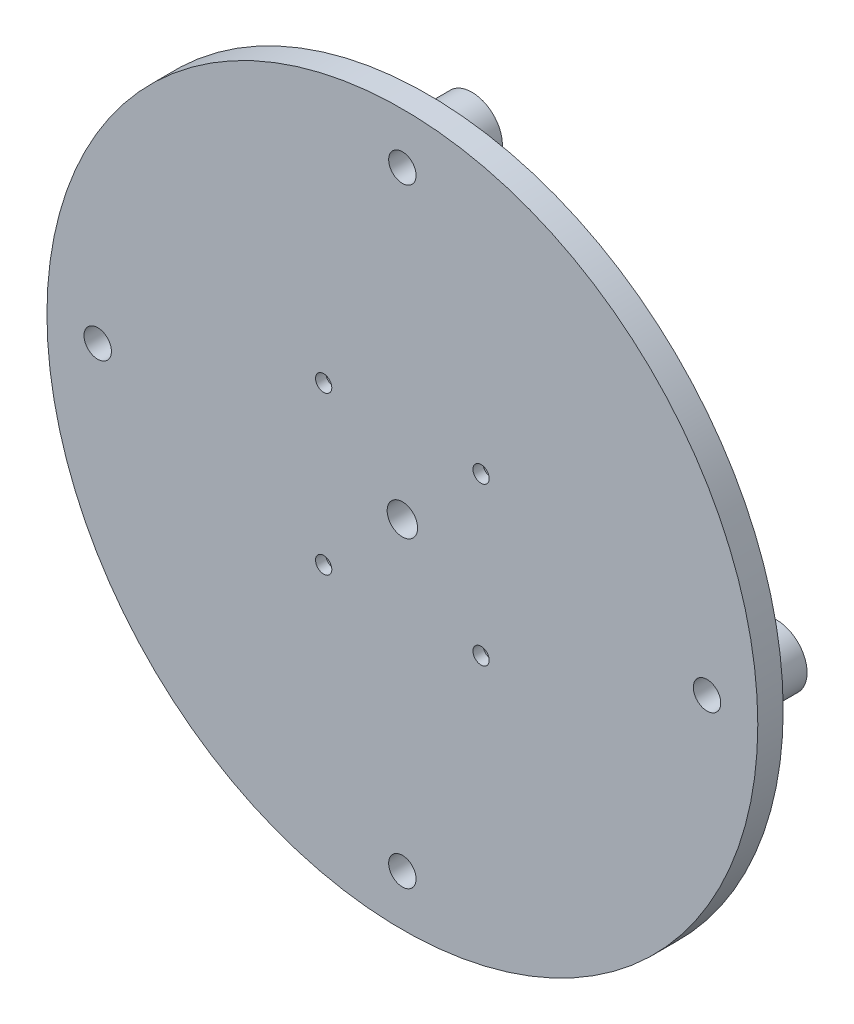
ISO-10303-21;
HEADER;
FILE_DESCRIPTION(('STEP AP214'),'2;1');
FILE_NAME('part.step','',(''),(''),'','','');
FILE_SCHEMA(('AUTOMOTIVE_DESIGN { 1 0 10303 214 1 1 1 1 }'));
ENDSEC;
DATA;
#1=APPLICATION_CONTEXT('core data for automotive mechanical design processes');
#2=APPLICATION_PROTOCOL_DEFINITION('international standard','automotive_design',2000,#1);
#3=PRODUCT_CONTEXT('',#1,'mechanical');
#4=PRODUCT('Part','Part','',(#3));
#5=PRODUCT_RELATED_PRODUCT_CATEGORY('part','',(#4));
#6=PRODUCT_DEFINITION_FORMATION('','',#4);
#7=PRODUCT_DEFINITION_CONTEXT('part definition',#1,'design');
#8=PRODUCT_DEFINITION('design','',#6,#7);
#9=PRODUCT_DEFINITION_SHAPE('','',#8);
#10=(LENGTH_UNIT() NAMED_UNIT(*) SI_UNIT(.MILLI.,.METRE.));
#11=(NAMED_UNIT(*) PLANE_ANGLE_UNIT() SI_UNIT($,.RADIAN.));
#12=(NAMED_UNIT(*) SI_UNIT($,.STERADIAN.) SOLID_ANGLE_UNIT());
#13=UNCERTAINTY_MEASURE_WITH_UNIT(LENGTH_MEASURE(1.E-05),#10,'distance_accuracy_value','');
#14=(GEOMETRIC_REPRESENTATION_CONTEXT(3) GLOBAL_UNCERTAINTY_ASSIGNED_CONTEXT((#13)) GLOBAL_UNIT_ASSIGNED_CONTEXT((#10,
#11,#12)) REPRESENTATION_CONTEXT('',''));
#15=CARTESIAN_POINT('',(0.,0.,0.));
#16=DIRECTION('',(0.,0.,1.));
#17=DIRECTION('',(1.,0.,0.));
#18=AXIS2_PLACEMENT_3D('',#15,#16,#17);
#19=CARTESIAN_POINT('',(60.0000000000017,1.69428074463191E-12,-10.));
#20=DIRECTION('',(0.,0.,1.));
#21=DIRECTION('',(1.,0.,0.));
#22=AXIS2_PLACEMENT_3D('',#19,#20,#21);
#23=CYLINDRICAL_SURFACE('',#22,1.60000000000133);
#24=CARTESIAN_POINT('',(60.0000000000017,1.69428074463191E-12,-8.7));
#25=DIRECTION('',(0.,0.,-1.));
#26=DIRECTION('',(-1.,0.,0.));
#27=AXIS2_PLACEMENT_3D('',#24,#25,#26);
#28=CIRCLE('',#27,1.60000000000133);
#29=CARTESIAN_POINT('',(58.4000000000004,1.69428074463191E-12,-8.7));
#30=VERTEX_POINT('',#29);
#31=EDGE_CURVE('E51',#30,#30,#28,.T.);
#32=ORIENTED_EDGE('',*,*,#31,.T.);
#33=EDGE_LOOP('',(#32));
#34=FACE_BOUND('',#33,.T.);
#35=CARTESIAN_POINT('',(60.0000000000017,1.69428074463191E-12,1.));
#36=DIRECTION('',(0.,0.,1.));
#37=DIRECTION('',(1.,0.,0.));
#38=AXIS2_PLACEMENT_3D('',#35,#36,#37);
#39=CIRCLE('',#38,1.60000000000133);
#40=CARTESIAN_POINT('',(61.600000000003,1.69428074463191E-12,1.));
#41=VERTEX_POINT('',#40);
#42=EDGE_CURVE('E38',#41,#41,#39,.F.);
#43=ORIENTED_EDGE('',*,*,#42,.F.);
#44=EDGE_LOOP('',(#43));
#45=FACE_BOUND('',#44,.T.);
#46=ADVANCED_FACE('F34',(#34,#45),#23,.F.);
#47=CARTESIAN_POINT('',(3.38856148926383E-12,-60.,-10.));
#48=DIRECTION('',(0.,0.,1.));
#49=DIRECTION('',(1.,0.,0.));
#50=AXIS2_PLACEMENT_3D('',#47,#48,#49);
#51=CYLINDRICAL_SURFACE('',#50,1.60000000000364);
#52=CARTESIAN_POINT('',(3.38856148926383E-12,-60.,-8.7));
#53=DIRECTION('',(0.,0.,-1.));
#54=DIRECTION('',(-1.,0.,0.));
#55=AXIS2_PLACEMENT_3D('',#52,#53,#54);
#56=CIRCLE('',#55,1.60000000000364);
#57=CARTESIAN_POINT('',(-1.60000000000025,-60.,-8.7));
#58=VERTEX_POINT('',#57);
#59=EDGE_CURVE('E54',#58,#58,#56,.T.);
#60=ORIENTED_EDGE('',*,*,#59,.T.);
#61=EDGE_LOOP('',(#60));
#62=FACE_BOUND('',#61,.T.);
#63=CARTESIAN_POINT('',(3.38856148926383E-12,-60.,1.));
#64=DIRECTION('',(0.,0.,1.));
#65=DIRECTION('',(1.,0.,0.));
#66=AXIS2_PLACEMENT_3D('',#63,#64,#65);
#67=CIRCLE('',#66,1.60000000000364);
#68=CARTESIAN_POINT('',(1.60000000000703,-60.,1.));
#69=VERTEX_POINT('',#68);
#70=EDGE_CURVE('E70',#69,#69,#67,.F.);
#71=ORIENTED_EDGE('',*,*,#70,.F.);
#72=EDGE_LOOP('',(#71));
#73=FACE_BOUND('',#72,.T.);
#74=ADVANCED_FACE('F80',(#62,#73),#51,.F.);
#75=CARTESIAN_POINT('',(-59.9999999999983,-1.7016286254268E-12,-10.));
#76=DIRECTION('',(0.,0.,1.));
#77=DIRECTION('',(1.,0.,0.));
#78=AXIS2_PLACEMENT_3D('',#75,#76,#77);
#79=CYLINDRICAL_SURFACE('',#78,1.60000000000273);
#80=CARTESIAN_POINT('',(-59.9999999999983,-1.7016286254268E-12,-8.7));
#81=DIRECTION('',(0.,0.,-1.));
#82=DIRECTION('',(-1.,0.,0.));
#83=AXIS2_PLACEMENT_3D('',#80,#81,#82);
#84=CIRCLE('',#83,1.60000000000273);
#85=CARTESIAN_POINT('',(-61.600000000001,-1.7016286254268E-12,-8.7));
#86=VERTEX_POINT('',#85);
#87=EDGE_CURVE('E57',#86,#86,#84,.T.);
#88=ORIENTED_EDGE('',*,*,#87,.T.);
#89=EDGE_LOOP('',(#88));
#90=FACE_BOUND('',#89,.T.);
#91=CARTESIAN_POINT('',(-59.9999999999983,-1.7016286254268E-12,1.));
#92=DIRECTION('',(0.,0.,1.));
#93=DIRECTION('',(1.,0.,0.));
#94=AXIS2_PLACEMENT_3D('',#91,#92,#93);
#95=CIRCLE('',#94,1.60000000000273);
#96=CARTESIAN_POINT('',(-58.3999999999956,-1.7016286254268E-12,1.));
#97=VERTEX_POINT('',#96);
#98=EDGE_CURVE('E67',#97,#97,#95,.F.);
#99=ORIENTED_EDGE('',*,*,#98,.F.);
#100=EDGE_LOOP('',(#99));
#101=FACE_BOUND('',#100,.T.);
#102=ADVANCED_FACE('F86',(#90,#101),#79,.F.);
#103=CARTESIAN_POINT('',(0.,60.,-10.));
#104=DIRECTION('',(0.,0.,1.));
#105=DIRECTION('',(1.,0.,0.));
#106=AXIS2_PLACEMENT_3D('',#103,#104,#105);
#107=CYLINDRICAL_SURFACE('',#106,1.6);
#108=CARTESIAN_POINT('',(0.,60.,-8.7));
#109=DIRECTION('',(0.,0.,-1.));
#110=DIRECTION('',(-1.,0.,0.));
#111=AXIS2_PLACEMENT_3D('',#108,#109,#110);
#112=CIRCLE('',#111,1.6);
#113=CARTESIAN_POINT('',(-1.6,60.,-8.7));
#114=VERTEX_POINT('',#113);
#115=EDGE_CURVE('E60',#114,#114,#112,.T.);
#116=ORIENTED_EDGE('',*,*,#115,.T.);
#117=EDGE_LOOP('',(#116));
#118=FACE_BOUND('',#117,.T.);
#119=CARTESIAN_POINT('',(0.,60.,1.));
#120=DIRECTION('',(0.,0.,1.));
#121=DIRECTION('',(1.,0.,0.));
#122=AXIS2_PLACEMENT_3D('',#119,#120,#121);
#123=CIRCLE('',#122,1.6);
#124=CARTESIAN_POINT('',(1.6,60.,1.));
#125=VERTEX_POINT('',#124);
#126=EDGE_CURVE('E64',#125,#125,#123,.F.);
#127=ORIENTED_EDGE('',*,*,#126,.F.);
#128=EDGE_LOOP('',(#127));
#129=FACE_BOUND('',#128,.T.);
#130=ADVANCED_FACE('F230',(#118,#129),#107,.F.);
#131=CARTESIAN_POINT('',(-15.5,15.5,0.));
#132=DIRECTION('',(0.,0.,1.));
#133=DIRECTION('',(1.,0.,0.));
#134=AXIS2_PLACEMENT_3D('',#131,#132,#133);
#135=CYLINDRICAL_SURFACE('',#134,1.6);
#136=CARTESIAN_POINT('',(-15.5,15.5,5.));
#137=DIRECTION('',(0.,0.,1.));
#138=DIRECTION('',(1.,0.,0.));
#139=AXIS2_PLACEMENT_3D('',#136,#137,#138);
#140=CIRCLE('',#139,1.6);
#141=CARTESIAN_POINT('',(-13.9,15.5,5.));
#142=VERTEX_POINT('',#141);
#143=EDGE_CURVE('E309',#142,#142,#140,.T.);
#144=ORIENTED_EDGE('',*,*,#143,.T.);
#145=EDGE_LOOP('',(#144));
#146=FACE_BOUND('',#145,.T.);
#147=CARTESIAN_POINT('',(-15.5,15.5,3.));
#148=DIRECTION('',(0.,0.,-1.));
#149=DIRECTION('',(-1.,0.,0.));
#150=AXIS2_PLACEMENT_3D('',#147,#148,#149);
#151=CIRCLE('',#150,1.6);
#152=CARTESIAN_POINT('',(-17.1,15.5,3.));
#153=VERTEX_POINT('',#152);
#154=EDGE_CURVE('E156',#153,#153,#151,.F.);
#155=ORIENTED_EDGE('',*,*,#154,.F.);
#156=EDGE_LOOP('',(#155));
#157=FACE_BOUND('',#156,.T.);
#158=ADVANCED_FACE('F220',(#146,#157),#135,.F.);
#159=CARTESIAN_POINT('',(15.5,15.5000000000009,0.));
#160=DIRECTION('',(0.,0.,1.));
#161=DIRECTION('',(1.,0.,0.));
#162=AXIS2_PLACEMENT_3D('',#159,#160,#161);
#163=CYLINDRICAL_SURFACE('',#162,1.60000000000091);
#164=CARTESIAN_POINT('',(15.5,15.5000000000009,5.));
#165=DIRECTION('',(0.,0.,1.));
#166=DIRECTION('',(1.,0.,0.));
#167=AXIS2_PLACEMENT_3D('',#164,#165,#166);
#168=CIRCLE('',#167,1.60000000000091);
#169=CARTESIAN_POINT('',(17.1000000000009,15.5000000000009,5.));
#170=VERTEX_POINT('',#169);
#171=EDGE_CURVE('E306',#170,#170,#168,.T.);
#172=ORIENTED_EDGE('',*,*,#171,.T.);
#173=EDGE_LOOP('',(#172));
#174=FACE_BOUND('',#173,.T.);
#175=CARTESIAN_POINT('',(15.5,15.5000000000009,3.));
#176=DIRECTION('',(0.,0.,-1.));
#177=DIRECTION('',(-1.,0.,0.));
#178=AXIS2_PLACEMENT_3D('',#175,#176,#177);
#179=CIRCLE('',#178,1.60000000000091);
#180=CARTESIAN_POINT('',(13.8999999999991,15.5000000000009,3.));
#181=VERTEX_POINT('',#180);
#182=EDGE_CURVE('E153',#181,#181,#179,.F.);
#183=ORIENTED_EDGE('',*,*,#182,.F.);
#184=EDGE_LOOP('',(#183));
#185=FACE_BOUND('',#184,.T.);
#186=ADVANCED_FACE('F216',(#174,#185),#163,.F.);
#187=CARTESIAN_POINT('',(15.5000000000009,-15.4999999999991,0.));
#188=DIRECTION('',(0.,0.,1.));
#189=DIRECTION('',(1.,0.,0.));
#190=AXIS2_PLACEMENT_3D('',#187,#188,#189);
#191=CYLINDRICAL_SURFACE('',#190,1.60000000000123);
#192=CARTESIAN_POINT('',(15.5000000000009,-15.4999999999991,5.));
#193=DIRECTION('',(0.,0.,1.));
#194=DIRECTION('',(1.,0.,0.));
#195=AXIS2_PLACEMENT_3D('',#192,#193,#194);
#196=CIRCLE('',#195,1.60000000000123);
#197=CARTESIAN_POINT('',(17.1000000000021,-15.4999999999991,5.));
#198=VERTEX_POINT('',#197);
#199=EDGE_CURVE('E310',#198,#198,#196,.T.);
#200=ORIENTED_EDGE('',*,*,#199,.T.);
#201=EDGE_LOOP('',(#200));
#202=FACE_BOUND('',#201,.T.);
#203=CARTESIAN_POINT('',(15.5000000000009,-15.4999999999991,3.));
#204=DIRECTION('',(0.,0.,-1.));
#205=DIRECTION('',(-1.,0.,0.));
#206=AXIS2_PLACEMENT_3D('',#203,#204,#205);
#207=CIRCLE('',#206,1.60000000000123);
#208=CARTESIAN_POINT('',(13.8999999999996,-15.4999999999991,3.));
#209=VERTEX_POINT('',#208);
#210=EDGE_CURVE('E149',#209,#209,#207,.F.);
#211=ORIENTED_EDGE('',*,*,#210,.F.);
#212=EDGE_LOOP('',(#211));
#213=FACE_BOUND('',#212,.T.);
#214=ADVANCED_FACE('F219',(#202,#213),#191,.F.);
#215=CARTESIAN_POINT('',(-15.4999999999991,-15.5,0.));
#216=DIRECTION('',(0.,0.,1.));
#217=DIRECTION('',(1.,0.,0.));
#218=AXIS2_PLACEMENT_3D('',#215,#216,#217);
#219=CYLINDRICAL_SURFACE('',#218,1.60000000000046);
#220=CARTESIAN_POINT('',(-15.4999999999991,-15.5,5.));
#221=DIRECTION('',(0.,0.,1.));
#222=DIRECTION('',(1.,0.,0.));
#223=AXIS2_PLACEMENT_3D('',#220,#221,#222);
#224=CIRCLE('',#223,1.60000000000046);
#225=CARTESIAN_POINT('',(-13.8999999999987,-15.5,5.));
#226=VERTEX_POINT('',#225);
#227=EDGE_CURVE('E159',#226,#226,#224,.T.);
#228=ORIENTED_EDGE('',*,*,#227,.T.);
#229=EDGE_LOOP('',(#228));
#230=FACE_BOUND('',#229,.T.);
#231=CARTESIAN_POINT('',(-15.4999999999991,-15.5,3.));
#232=DIRECTION('',(0.,0.,-1.));
#233=DIRECTION('',(-1.,0.,0.));
#234=AXIS2_PLACEMENT_3D('',#231,#232,#233);
#235=CIRCLE('',#234,1.60000000000046);
#236=CARTESIAN_POINT('',(-17.0999999999996,-15.5,3.));
#237=VERTEX_POINT('',#236);
#238=EDGE_CURVE('E146',#237,#237,#235,.F.);
#239=ORIENTED_EDGE('',*,*,#238,.F.);
#240=EDGE_LOOP('',(#239));
#241=FACE_BOUND('',#240,.T.);
#242=ADVANCED_FACE('F224',(#230,#241),#219,.F.);
#243=CARTESIAN_POINT('',(0.,0.,5.));
#244=DIRECTION('',(0.,0.,-1.));
#245=DIRECTION('',(-1.,0.,0.));
#246=AXIS2_PLACEMENT_3D('',#243,#244,#245);
#247=CYLINDRICAL_SURFACE('',#246,70.);
#248=CARTESIAN_POINT('',(0.,0.,5.));
#249=DIRECTION('',(0.,0.,1.));
#250=DIRECTION('',(1.,0.,0.));
#251=AXIS2_PLACEMENT_3D('',#248,#249,#250);
#252=CIRCLE('',#251,70.);
#253=CARTESIAN_POINT('',(70.,0.,5.));
#254=VERTEX_POINT('',#253);
#255=EDGE_CURVE('E138',#254,#254,#252,.T.);
#256=ORIENTED_EDGE('',*,*,#255,.F.);
#257=EDGE_LOOP('',(#256));
#258=FACE_BOUND('',#257,.T.);
#259=CARTESIAN_POINT('',(0.,0.,0.));
#260=DIRECTION('',(0.,0.,1.));
#261=DIRECTION('',(1.,0.,0.));
#262=AXIS2_PLACEMENT_3D('',#259,#260,#261);
#263=CIRCLE('',#262,70.);
#264=CARTESIAN_POINT('',(70.,0.,0.));
#265=VERTEX_POINT('',#264);
#266=EDGE_CURVE('E136',#265,#265,#263,.T.);
#267=ORIENTED_EDGE('',*,*,#266,.T.);
#268=EDGE_LOOP('',(#267));
#269=FACE_BOUND('',#268,.T.);
#270=ADVANCED_FACE('F36',(#258,#269),#247,.T.);
#271=CARTESIAN_POINT('',(0.,0.,5.));
#272=DIRECTION('',(0.,0.,1.));
#273=DIRECTION('',(1.,0.,0.));
#274=AXIS2_PLACEMENT_3D('',#271,#272,#273);
#275=PLANE('',#274);
#276=CARTESIAN_POINT('',(0.,60.,5.));
#277=DIRECTION('',(0.,0.,1.));
#278=DIRECTION('',(1.,0.,0.));
#279=AXIS2_PLACEMENT_3D('',#276,#277,#278);
#280=CIRCLE('',#279,2.7);
#281=CARTESIAN_POINT('',(2.7,60.,5.));
#282=VERTEX_POINT('',#281);
#283=EDGE_CURVE('E636',#282,#282,#280,.T.);
#284=ORIENTED_EDGE('',*,*,#283,.F.);
#285=EDGE_LOOP('',(#284));
#286=FACE_BOUND('',#285,.T.);
#287=CARTESIAN_POINT('',(60.0000000000017,1.69428074463191E-12,5.));
#288=DIRECTION('',(0.,0.,1.));
#289=DIRECTION('',(1.,0.,0.));
#290=AXIS2_PLACEMENT_3D('',#287,#288,#289);
#291=CIRCLE('',#290,2.70000000000133);
#292=CARTESIAN_POINT('',(62.700000000003,1.69428074463191E-12,5.));
#293=VERTEX_POINT('',#292);
#294=EDGE_CURVE('E634',#293,#293,#291,.T.);
#295=ORIENTED_EDGE('',*,*,#294,.F.);
#296=EDGE_LOOP('',(#295));
#297=FACE_BOUND('',#296,.T.);
#298=CARTESIAN_POINT('',(3.38856148926383E-12,-60.,5.));
#299=DIRECTION('',(0.,0.,1.));
#300=DIRECTION('',(1.,0.,0.));
#301=AXIS2_PLACEMENT_3D('',#298,#299,#300);
#302=CIRCLE('',#301,2.70000000000364);
#303=CARTESIAN_POINT('',(2.70000000000703,-60.,5.));
#304=VERTEX_POINT('',#303);
#305=EDGE_CURVE('E640',#304,#304,#302,.T.);
#306=ORIENTED_EDGE('',*,*,#305,.F.);
#307=EDGE_LOOP('',(#306));
#308=FACE_BOUND('',#307,.T.);
#309=CARTESIAN_POINT('',(-59.9999999999983,-1.7016286254268E-12,5.));
#310=DIRECTION('',(0.,0.,1.));
#311=DIRECTION('',(1.,0.,0.));
#312=AXIS2_PLACEMENT_3D('',#309,#310,#311);
#313=CIRCLE('',#312,2.70000000000273);
#314=CARTESIAN_POINT('',(-57.2999999999956,-1.7016286254268E-12,5.));
#315=VERTEX_POINT('',#314);
#316=EDGE_CURVE('E649',#315,#315,#313,.T.);
#317=ORIENTED_EDGE('',*,*,#316,.F.);
#318=EDGE_LOOP('',(#317));
#319=FACE_BOUND('',#318,.T.);
#320=ORIENTED_EDGE('',*,*,#227,.F.);
#321=EDGE_LOOP('',(#320));
#322=FACE_BOUND('',#321,.T.);
#323=ORIENTED_EDGE('',*,*,#199,.F.);
#324=EDGE_LOOP('',(#323));
#325=FACE_BOUND('',#324,.T.);
#326=ORIENTED_EDGE('',*,*,#171,.F.);
#327=EDGE_LOOP('',(#326));
#328=FACE_BOUND('',#327,.T.);
#329=ORIENTED_EDGE('',*,*,#143,.F.);
#330=EDGE_LOOP('',(#329));
#331=FACE_BOUND('',#330,.T.);
#332=CARTESIAN_POINT('',(0.,0.,5.));
#333=DIRECTION('',(0.,0.,1.));
#334=DIRECTION('',(1.,0.,0.));
#335=AXIS2_PLACEMENT_3D('',#332,#333,#334);
#336=CIRCLE('',#335,3.);
#337=CARTESIAN_POINT('',(3.,0.,5.));
#338=VERTEX_POINT('',#337);
#339=EDGE_CURVE('E142',#338,#338,#336,.T.);
#340=ORIENTED_EDGE('',*,*,#339,.F.);
#341=EDGE_LOOP('',(#340));
#342=FACE_BOUND('',#341,.T.);
#343=ORIENTED_EDGE('',*,*,#255,.T.);
#344=EDGE_LOOP('',(#343));
#345=FACE_BOUND('',#344,.T.);
#346=ADVANCED_FACE('F91',(#286,#297,#308,#319,#322,#325,#328,#331,#342,#345),#275,.T.);
#347=CARTESIAN_POINT('',(0.,0.,0.));
#348=DIRECTION('',(0.,0.,1.));
#349=DIRECTION('',(1.,0.,0.));
#350=AXIS2_PLACEMENT_3D('',#347,#348,#349);
#351=PLANE('',#350);
#352=CARTESIAN_POINT('',(59.9999999999992,-8.48977342514678E-13,0.));
#353=DIRECTION('',(0.,0.,1.));
#354=DIRECTION('',(1.,0.,0.));
#355=AXIS2_PLACEMENT_3D('',#352,#353,#354);
#356=CIRCLE('',#355,5.99999999999999);
#357=CARTESIAN_POINT('',(65.9999999999992,-8.48977342514678E-13,0.));
#358=VERTEX_POINT('',#357);
#359=EDGE_CURVE('E10',#358,#358,#356,.F.);
#360=ORIENTED_EDGE('',*,*,#359,.F.);
#361=EDGE_LOOP('',(#360));
#362=FACE_BOUND('',#361,.T.);
#363=CARTESIAN_POINT('',(-1.68325892343959E-12,-60.,0.));
#364=DIRECTION('',(0.,0.,1.));
#365=DIRECTION('',(1.,0.,0.));
#366=AXIS2_PLACEMENT_3D('',#363,#364,#365);
#367=CIRCLE('',#366,6.);
#368=CARTESIAN_POINT('',(5.99999999999832,-60.,0.));
#369=VERTEX_POINT('',#368);
#370=EDGE_CURVE('E42',#369,#369,#367,.F.);
#371=ORIENTED_EDGE('',*,*,#370,.F.);
#372=EDGE_LOOP('',(#371));
#373=FACE_BOUND('',#372,.T.);
#374=CARTESIAN_POINT('',(-60.,-2.09488880330588E-13,0.));
#375=DIRECTION('',(0.,0.,1.));
#376=DIRECTION('',(1.,0.,0.));
#377=AXIS2_PLACEMENT_3D('',#374,#375,#376);
#378=CIRCLE('',#377,6.);
#379=CARTESIAN_POINT('',(-54.,-2.09488880330588E-13,0.));
#380=VERTEX_POINT('',#379);
#381=EDGE_CURVE('E47',#380,#380,#378,.F.);
#382=ORIENTED_EDGE('',*,*,#381,.F.);
#383=EDGE_LOOP('',(#382));
#384=FACE_BOUND('',#383,.T.);
#385=CARTESIAN_POINT('',(0.,60.,0.));
#386=DIRECTION('',(0.,0.,1.));
#387=DIRECTION('',(1.,0.,0.));
#388=AXIS2_PLACEMENT_3D('',#385,#386,#387);
#389=CIRCLE('',#388,6.);
#390=CARTESIAN_POINT('',(6.,60.,0.));
#391=VERTEX_POINT('',#390);
#392=EDGE_CURVE('E113',#391,#391,#389,.F.);
#393=ORIENTED_EDGE('',*,*,#392,.F.);
#394=EDGE_LOOP('',(#393));
#395=FACE_BOUND('',#394,.T.);
#396=CARTESIAN_POINT('',(15.5,-15.5,0.));
#397=DIRECTION('',(0.,0.,-1.));
#398=DIRECTION('',(-1.,0.,0.));
#399=AXIS2_PLACEMENT_3D('',#396,#397,#398);
#400=CIRCLE('',#399,2.80000000000046);
#401=CARTESIAN_POINT('',(12.6999999999995,-15.5,0.));
#402=VERTEX_POINT('',#401);
#403=EDGE_CURVE('E117',#402,#402,#400,.T.);
#404=ORIENTED_EDGE('',*,*,#403,.F.);
#405=EDGE_LOOP('',(#404));
#406=FACE_BOUND('',#405,.T.);
#407=CARTESIAN_POINT('',(-15.5000000000009,-15.5,0.));
#408=DIRECTION('',(0.,0.,-1.));
#409=DIRECTION('',(-1.,0.,0.));
#410=AXIS2_PLACEMENT_3D('',#407,#408,#409);
#411=CIRCLE('',#410,2.80000000000123);
#412=CARTESIAN_POINT('',(-18.3000000000021,-15.5,0.));
#413=VERTEX_POINT('',#412);
#414=EDGE_CURVE('E121',#413,#413,#411,.T.);
#415=ORIENTED_EDGE('',*,*,#414,.F.);
#416=EDGE_LOOP('',(#415));
#417=FACE_BOUND('',#416,.T.);
#418=CARTESIAN_POINT('',(-15.5000000000009,15.5000000000009,0.));
#419=DIRECTION('',(0.,0.,-1.));
#420=DIRECTION('',(-1.,0.,0.));
#421=AXIS2_PLACEMENT_3D('',#418,#419,#420);
#422=CIRCLE('',#421,2.8000000000009);
#423=CARTESIAN_POINT('',(-18.3000000000018,15.5000000000009,0.));
#424=VERTEX_POINT('',#423);
#425=EDGE_CURVE('E125',#424,#424,#422,.T.);
#426=ORIENTED_EDGE('',*,*,#425,.F.);
#427=EDGE_LOOP('',(#426));
#428=FACE_BOUND('',#427,.T.);
#429=CARTESIAN_POINT('',(15.5,15.5000000000009,0.));
#430=DIRECTION('',(0.,0.,-1.));
#431=DIRECTION('',(-1.,0.,0.));
#432=AXIS2_PLACEMENT_3D('',#429,#430,#431);
#433=CIRCLE('',#432,2.8);
#434=CARTESIAN_POINT('',(12.7,15.5000000000009,0.));
#435=VERTEX_POINT('',#434);
#436=EDGE_CURVE('E129',#435,#435,#433,.T.);
#437=ORIENTED_EDGE('',*,*,#436,.F.);
#438=EDGE_LOOP('',(#437));
#439=FACE_BOUND('',#438,.T.);
#440=CARTESIAN_POINT('',(0.,0.,0.));
#441=DIRECTION('',(0.,0.,1.));
#442=DIRECTION('',(1.,0.,0.));
#443=AXIS2_PLACEMENT_3D('',#440,#441,#442);
#444=CIRCLE('',#443,3.);
#445=CARTESIAN_POINT('',(3.,0.,0.));
#446=VERTEX_POINT('',#445);
#447=EDGE_CURVE('E133',#446,#446,#444,.T.);
#448=ORIENTED_EDGE('',*,*,#447,.T.);
#449=EDGE_LOOP('',(#448));
#450=FACE_BOUND('',#449,.T.);
#451=ORIENTED_EDGE('',*,*,#266,.F.);
#452=EDGE_LOOP('',(#451));
#453=FACE_BOUND('',#452,.T.);
#454=ADVANCED_FACE('F93',(#362,#373,#384,#395,#406,#417,#428,#439,#450,#453),#351,.F.);
#455=CARTESIAN_POINT('',(0.,0.,0.));
#456=DIRECTION('',(0.,0.,1.));
#457=DIRECTION('',(1.,0.,0.));
#458=AXIS2_PLACEMENT_3D('',#455,#456,#457);
#459=CYLINDRICAL_SURFACE('',#458,3.);
#460=ORIENTED_EDGE('',*,*,#447,.F.);
#461=EDGE_LOOP('',(#460));
#462=FACE_BOUND('',#461,.T.);
#463=ORIENTED_EDGE('',*,*,#339,.T.);
#464=EDGE_LOOP('',(#463));
#465=FACE_BOUND('',#464,.T.);
#466=ADVANCED_FACE('F96',(#462,#465),#459,.F.);
#467=CARTESIAN_POINT('',(-15.5000000000009,-15.5,3.));
#468=DIRECTION('',(0.,0.,-1.));
#469=DIRECTION('',(-1.,0.,0.));
#470=AXIS2_PLACEMENT_3D('',#467,#468,#469);
#471=PLANE('',#470);
#472=CARTESIAN_POINT('',(-15.5000000000009,-15.5,3.));
#473=DIRECTION('',(0.,0.,-1.));
#474=DIRECTION('',(-1.,0.,0.));
#475=AXIS2_PLACEMENT_3D('',#472,#473,#474);
#476=CIRCLE('',#475,2.80000000000123);
#477=CARTESIAN_POINT('',(-18.3000000000021,-15.5,3.));
#478=VERTEX_POINT('',#477);
#479=EDGE_CURVE('E297',#478,#478,#476,.T.);
#480=ORIENTED_EDGE('',*,*,#479,.T.);
#481=EDGE_LOOP('',(#480));
#482=FACE_BOUND('',#481,.T.);
#483=ORIENTED_EDGE('',*,*,#238,.T.);
#484=EDGE_LOOP('',(#483));
#485=FACE_BOUND('',#484,.T.);
#486=ADVANCED_FACE('F101',(#482,#485),#471,.T.);
#487=CARTESIAN_POINT('',(-15.5000000000009,-15.5,3.));
#488=DIRECTION('',(0.,0.,-1.));
#489=DIRECTION('',(-1.,0.,0.));
#490=AXIS2_PLACEMENT_3D('',#487,#488,#489);
#491=CYLINDRICAL_SURFACE('',#490,2.80000000000123);
#492=ORIENTED_EDGE('',*,*,#479,.F.);
#493=EDGE_LOOP('',(#492));
#494=FACE_BOUND('',#493,.T.);
#495=ORIENTED_EDGE('',*,*,#414,.T.);
#496=EDGE_LOOP('',(#495));
#497=FACE_BOUND('',#496,.T.);
#498=ADVANCED_FACE('F194',(#494,#497),#491,.F.);
#499=CARTESIAN_POINT('',(15.5,-15.5,3.));
#500=DIRECTION('',(0.,0.,-1.));
#501=DIRECTION('',(-1.,0.,0.));
#502=AXIS2_PLACEMENT_3D('',#499,#500,#501);
#503=PLANE('',#502);
#504=CARTESIAN_POINT('',(15.5,-15.5,3.));
#505=DIRECTION('',(0.,0.,-1.));
#506=DIRECTION('',(-1.,0.,0.));
#507=AXIS2_PLACEMENT_3D('',#504,#505,#506);
#508=CIRCLE('',#507,2.80000000000046);
#509=CARTESIAN_POINT('',(12.6999999999995,-15.5,3.));
#510=VERTEX_POINT('',#509);
#511=EDGE_CURVE('E291',#510,#510,#508,.T.);
#512=ORIENTED_EDGE('',*,*,#511,.T.);
#513=EDGE_LOOP('',(#512));
#514=FACE_BOUND('',#513,.T.);
#515=ORIENTED_EDGE('',*,*,#210,.T.);
#516=EDGE_LOOP('',(#515));
#517=FACE_BOUND('',#516,.T.);
#518=ADVANCED_FACE('F197',(#514,#517),#503,.T.);
#519=CARTESIAN_POINT('',(15.5,-15.5,3.));
#520=DIRECTION('',(0.,0.,-1.));
#521=DIRECTION('',(-1.,0.,0.));
#522=AXIS2_PLACEMENT_3D('',#519,#520,#521);
#523=CYLINDRICAL_SURFACE('',#522,2.80000000000046);
#524=ORIENTED_EDGE('',*,*,#511,.F.);
#525=EDGE_LOOP('',(#524));
#526=FACE_BOUND('',#525,.T.);
#527=ORIENTED_EDGE('',*,*,#403,.T.);
#528=EDGE_LOOP('',(#527));
#529=FACE_BOUND('',#528,.T.);
#530=ADVANCED_FACE('F202',(#526,#529),#523,.F.);
#531=CARTESIAN_POINT('',(15.5,15.5000000000009,3.));
#532=DIRECTION('',(0.,0.,-1.));
#533=DIRECTION('',(-1.,0.,0.));
#534=AXIS2_PLACEMENT_3D('',#531,#532,#533);
#535=PLANE('',#534);
#536=CARTESIAN_POINT('',(15.5,15.5000000000009,3.));
#537=DIRECTION('',(0.,0.,-1.));
#538=DIRECTION('',(-1.,0.,0.));
#539=AXIS2_PLACEMENT_3D('',#536,#537,#538);
#540=CIRCLE('',#539,2.8);
#541=CARTESIAN_POINT('',(12.7,15.5000000000009,3.));
#542=VERTEX_POINT('',#541);
#543=EDGE_CURVE('E150',#542,#542,#540,.T.);
#544=ORIENTED_EDGE('',*,*,#543,.T.);
#545=EDGE_LOOP('',(#544));
#546=FACE_BOUND('',#545,.T.);
#547=ORIENTED_EDGE('',*,*,#182,.T.);
#548=EDGE_LOOP('',(#547));
#549=FACE_BOUND('',#548,.T.);
#550=ADVANCED_FACE('F205',(#546,#549),#535,.T.);
#551=CARTESIAN_POINT('',(15.5,15.5000000000009,3.));
#552=DIRECTION('',(0.,0.,-1.));
#553=DIRECTION('',(-1.,0.,0.));
#554=AXIS2_PLACEMENT_3D('',#551,#552,#553);
#555=CYLINDRICAL_SURFACE('',#554,2.8);
#556=ORIENTED_EDGE('',*,*,#543,.F.);
#557=EDGE_LOOP('',(#556));
#558=FACE_BOUND('',#557,.T.);
#559=ORIENTED_EDGE('',*,*,#436,.T.);
#560=EDGE_LOOP('',(#559));
#561=FACE_BOUND('',#560,.T.);
#562=ADVANCED_FACE('F192',(#558,#561),#555,.F.);
#563=CARTESIAN_POINT('',(-15.5000000000009,15.5000000000009,3.));
#564=DIRECTION('',(0.,0.,-1.));
#565=DIRECTION('',(-1.,0.,0.));
#566=AXIS2_PLACEMENT_3D('',#563,#564,#565);
#567=PLANE('',#566);
#568=CARTESIAN_POINT('',(-15.5000000000009,15.5000000000009,3.));
#569=DIRECTION('',(0.,0.,-1.));
#570=DIRECTION('',(-1.,0.,0.));
#571=AXIS2_PLACEMENT_3D('',#568,#569,#570);
#572=CIRCLE('',#571,2.8000000000009);
#573=CARTESIAN_POINT('',(-18.3000000000018,15.5000000000009,3.));
#574=VERTEX_POINT('',#573);
#575=EDGE_CURVE('E293',#574,#574,#572,.T.);
#576=ORIENTED_EDGE('',*,*,#575,.T.);
#577=EDGE_LOOP('',(#576));
#578=FACE_BOUND('',#577,.T.);
#579=ORIENTED_EDGE('',*,*,#154,.T.);
#580=EDGE_LOOP('',(#579));
#581=FACE_BOUND('',#580,.T.);
#582=ADVANCED_FACE('F188',(#578,#581),#567,.T.);
#583=CARTESIAN_POINT('',(-15.5000000000009,15.5000000000009,3.));
#584=DIRECTION('',(0.,0.,-1.));
#585=DIRECTION('',(-1.,0.,0.));
#586=AXIS2_PLACEMENT_3D('',#583,#584,#585);
#587=CYLINDRICAL_SURFACE('',#586,2.8000000000009);
#588=ORIENTED_EDGE('',*,*,#575,.F.);
#589=EDGE_LOOP('',(#588));
#590=FACE_BOUND('',#589,.T.);
#591=ORIENTED_EDGE('',*,*,#425,.T.);
#592=EDGE_LOOP('',(#591));
#593=FACE_BOUND('',#592,.T.);
#594=ADVANCED_FACE('F184',(#590,#593),#587,.F.);
#595=CARTESIAN_POINT('',(0.,60.,-8.7));
#596=DIRECTION('',(0.,0.,1.));
#597=DIRECTION('',(1.,0.,0.));
#598=AXIS2_PLACEMENT_3D('',#595,#596,#597);
#599=CYLINDRICAL_SURFACE('',#598,6.);
#600=CARTESIAN_POINT('',(0.,60.,-8.7));
#601=DIRECTION('',(0.,0.,-1.));
#602=DIRECTION('',(-1.,0.,0.));
#603=AXIS2_PLACEMENT_3D('',#600,#601,#602);
#604=CIRCLE('',#603,6.);
#605=CARTESIAN_POINT('',(-6.,60.,-8.7));
#606=VERTEX_POINT('',#605);
#607=EDGE_CURVE('E283',#606,#606,#604,.T.);
#608=ORIENTED_EDGE('',*,*,#607,.F.);
#609=EDGE_LOOP('',(#608));
#610=FACE_BOUND('',#609,.T.);
#611=ORIENTED_EDGE('',*,*,#392,.T.);
#612=EDGE_LOOP('',(#611));
#613=FACE_BOUND('',#612,.T.);
#614=ADVANCED_FACE('F174',(#610,#613),#599,.T.);
#615=CARTESIAN_POINT('',(0.,60.,-8.7));
#616=DIRECTION('',(0.,0.,-1.));
#617=DIRECTION('',(-1.,0.,0.));
#618=AXIS2_PLACEMENT_3D('',#615,#616,#617);
#619=PLANE('',#618);
#620=ORIENTED_EDGE('',*,*,#115,.F.);
#621=EDGE_LOOP('',(#620));
#622=FACE_BOUND('',#621,.T.);
#623=ORIENTED_EDGE('',*,*,#607,.T.);
#624=EDGE_LOOP('',(#623));
#625=FACE_BOUND('',#624,.T.);
#626=ADVANCED_FACE('F164',(#622,#625),#619,.T.);
#627=CARTESIAN_POINT('',(-60.,-2.09488880330588E-13,-8.7));
#628=DIRECTION('',(0.,0.,1.));
#629=DIRECTION('',(1.,0.,0.));
#630=AXIS2_PLACEMENT_3D('',#627,#628,#629);
#631=CYLINDRICAL_SURFACE('',#630,6.);
#632=CARTESIAN_POINT('',(-60.,-2.09488880330588E-13,-8.7));
#633=DIRECTION('',(0.,0.,-1.));
#634=DIRECTION('',(-1.,0.,0.));
#635=AXIS2_PLACEMENT_3D('',#632,#633,#634);
#636=CIRCLE('',#635,6.);
#637=CARTESIAN_POINT('',(-66.,-2.09488880330588E-13,-8.7));
#638=VERTEX_POINT('',#637);
#639=EDGE_CURVE('E280',#638,#638,#636,.T.);
#640=ORIENTED_EDGE('',*,*,#639,.F.);
#641=EDGE_LOOP('',(#640));
#642=FACE_BOUND('',#641,.T.);
#643=ORIENTED_EDGE('',*,*,#381,.T.);
#644=EDGE_LOOP('',(#643));
#645=FACE_BOUND('',#644,.T.);
#646=ADVANCED_FACE('F161',(#642,#645),#631,.T.);
#647=CARTESIAN_POINT('',(-60.,-2.09488880330588E-13,-8.7));
#648=DIRECTION('',(0.,0.,-1.));
#649=DIRECTION('',(-1.,0.,0.));
#650=AXIS2_PLACEMENT_3D('',#647,#648,#649);
#651=PLANE('',#650);
#652=ORIENTED_EDGE('',*,*,#87,.F.);
#653=EDGE_LOOP('',(#652));
#654=FACE_BOUND('',#653,.T.);
#655=ORIENTED_EDGE('',*,*,#639,.T.);
#656=EDGE_LOOP('',(#655));
#657=FACE_BOUND('',#656,.T.);
#658=ADVANCED_FACE('F163',(#654,#657),#651,.T.);
#659=CARTESIAN_POINT('',(-1.68325892343959E-12,-60.,-8.7));
#660=DIRECTION('',(0.,0.,1.));
#661=DIRECTION('',(1.,0.,0.));
#662=AXIS2_PLACEMENT_3D('',#659,#660,#661);
#663=CYLINDRICAL_SURFACE('',#662,6.);
#664=CARTESIAN_POINT('',(-1.68325892343959E-12,-60.,-8.7));
#665=DIRECTION('',(0.,0.,-1.));
#666=DIRECTION('',(-1.,0.,0.));
#667=AXIS2_PLACEMENT_3D('',#664,#665,#666);
#668=CIRCLE('',#667,6.);
#669=CARTESIAN_POINT('',(-6.00000000000168,-60.,-8.7));
#670=VERTEX_POINT('',#669);
#671=EDGE_CURVE('E278',#670,#670,#668,.T.);
#672=ORIENTED_EDGE('',*,*,#671,.F.);
#673=EDGE_LOOP('',(#672));
#674=FACE_BOUND('',#673,.T.);
#675=ORIENTED_EDGE('',*,*,#370,.T.);
#676=EDGE_LOOP('',(#675));
#677=FACE_BOUND('',#676,.T.);
#678=ADVANCED_FACE('F171',(#674,#677),#663,.T.);
#679=CARTESIAN_POINT('',(-1.68325892343959E-12,-60.,-8.7));
#680=DIRECTION('',(0.,0.,-1.));
#681=DIRECTION('',(-1.,0.,0.));
#682=AXIS2_PLACEMENT_3D('',#679,#680,#681);
#683=PLANE('',#682);
#684=ORIENTED_EDGE('',*,*,#59,.F.);
#685=EDGE_LOOP('',(#684));
#686=FACE_BOUND('',#685,.T.);
#687=ORIENTED_EDGE('',*,*,#671,.T.);
#688=EDGE_LOOP('',(#687));
#689=FACE_BOUND('',#688,.T.);
#690=ADVANCED_FACE('F179',(#686,#689),#683,.T.);
#691=CARTESIAN_POINT('',(59.9999999999992,-8.48977342514678E-13,-8.7));
#692=DIRECTION('',(0.,0.,1.));
#693=DIRECTION('',(1.,0.,0.));
#694=AXIS2_PLACEMENT_3D('',#691,#692,#693);
#695=CYLINDRICAL_SURFACE('',#694,5.99999999999999);
#696=CARTESIAN_POINT('',(59.9999999999992,-8.48977342514678E-13,-8.7));
#697=DIRECTION('',(0.,0.,-1.));
#698=DIRECTION('',(-1.,0.,0.));
#699=AXIS2_PLACEMENT_3D('',#696,#697,#698);
#700=CIRCLE('',#699,5.99999999999999);
#701=CARTESIAN_POINT('',(53.9999999999992,-8.48977342514678E-13,-8.7));
#702=VERTEX_POINT('',#701);
#703=EDGE_CURVE('E63',#702,#702,#700,.T.);
#704=ORIENTED_EDGE('',*,*,#703,.F.);
#705=EDGE_LOOP('',(#704));
#706=FACE_BOUND('',#705,.T.);
#707=ORIENTED_EDGE('',*,*,#359,.T.);
#708=EDGE_LOOP('',(#707));
#709=FACE_BOUND('',#708,.T.);
#710=ADVANCED_FACE('F262',(#706,#709),#695,.T.);
#711=CARTESIAN_POINT('',(59.9999999999992,-8.48977342514678E-13,-8.7));
#712=DIRECTION('',(0.,0.,-1.));
#713=DIRECTION('',(-1.,0.,0.));
#714=AXIS2_PLACEMENT_3D('',#711,#712,#713);
#715=PLANE('',#714);
#716=ORIENTED_EDGE('',*,*,#31,.F.);
#717=EDGE_LOOP('',(#716));
#718=FACE_BOUND('',#717,.T.);
#719=ORIENTED_EDGE('',*,*,#703,.T.);
#720=EDGE_LOOP('',(#719));
#721=FACE_BOUND('',#720,.T.);
#722=ADVANCED_FACE('F265',(#718,#721),#715,.T.);
#723=CARTESIAN_POINT('',(0.,60.,1.));
#724=DIRECTION('',(0.,0.,1.));
#725=DIRECTION('',(1.,0.,0.));
#726=AXIS2_PLACEMENT_3D('',#723,#724,#725);
#727=PLANE('',#726);
#728=CARTESIAN_POINT('',(0.,60.,1.));
#729=DIRECTION('',(0.,0.,1.));
#730=DIRECTION('',(1.,0.,0.));
#731=AXIS2_PLACEMENT_3D('',#728,#729,#730);
#732=CIRCLE('',#731,2.7);
#733=CARTESIAN_POINT('',(2.7,60.,1.));
#734=VERTEX_POINT('',#733);
#735=EDGE_CURVE('E68',#734,#734,#732,.T.);
#736=ORIENTED_EDGE('',*,*,#735,.T.);
#737=EDGE_LOOP('',(#736));
#738=FACE_BOUND('',#737,.T.);
#739=ORIENTED_EDGE('',*,*,#126,.T.);
#740=EDGE_LOOP('',(#739));
#741=FACE_BOUND('',#740,.T.);
#742=ADVANCED_FACE('F256',(#738,#741),#727,.T.);
#743=CARTESIAN_POINT('',(0.,60.,1.));
#744=DIRECTION('',(0.,0.,1.));
#745=DIRECTION('',(1.,0.,0.));
#746=AXIS2_PLACEMENT_3D('',#743,#744,#745);
#747=CYLINDRICAL_SURFACE('',#746,2.7);
#748=ORIENTED_EDGE('',*,*,#735,.F.);
#749=EDGE_LOOP('',(#748));
#750=FACE_BOUND('',#749,.T.);
#751=ORIENTED_EDGE('',*,*,#283,.T.);
#752=EDGE_LOOP('',(#751));
#753=FACE_BOUND('',#752,.T.);
#754=ADVANCED_FACE('F246',(#750,#753),#747,.F.);
#755=CARTESIAN_POINT('',(-59.9999999999983,-1.7016286254268E-12,1.));
#756=DIRECTION('',(0.,0.,1.));
#757=DIRECTION('',(1.,0.,0.));
#758=AXIS2_PLACEMENT_3D('',#755,#756,#757);
#759=PLANE('',#758);
#760=CARTESIAN_POINT('',(-59.9999999999983,-1.7016286254268E-12,1.));
#761=DIRECTION('',(0.,0.,1.));
#762=DIRECTION('',(1.,0.,0.));
#763=AXIS2_PLACEMENT_3D('',#760,#761,#762);
#764=CIRCLE('',#763,2.70000000000273);
#765=CARTESIAN_POINT('',(-57.2999999999956,-1.7016286254268E-12,1.));
#766=VERTEX_POINT('',#765);
#767=EDGE_CURVE('E651',#766,#766,#764,.T.);
#768=ORIENTED_EDGE('',*,*,#767,.T.);
#769=EDGE_LOOP('',(#768));
#770=FACE_BOUND('',#769,.T.);
#771=ORIENTED_EDGE('',*,*,#98,.T.);
#772=EDGE_LOOP('',(#771));
#773=FACE_BOUND('',#772,.T.);
#774=ADVANCED_FACE('F243',(#770,#773),#759,.T.);
#775=CARTESIAN_POINT('',(-59.9999999999983,-1.7016286254268E-12,1.));
#776=DIRECTION('',(0.,0.,1.));
#777=DIRECTION('',(1.,0.,0.));
#778=AXIS2_PLACEMENT_3D('',#775,#776,#777);
#779=CYLINDRICAL_SURFACE('',#778,2.70000000000273);
#780=ORIENTED_EDGE('',*,*,#767,.F.);
#781=EDGE_LOOP('',(#780));
#782=FACE_BOUND('',#781,.T.);
#783=ORIENTED_EDGE('',*,*,#316,.T.);
#784=EDGE_LOOP('',(#783));
#785=FACE_BOUND('',#784,.T.);
#786=ADVANCED_FACE('F245',(#782,#785),#779,.F.);
#787=CARTESIAN_POINT('',(3.38856148926383E-12,-60.,1.));
#788=DIRECTION('',(0.,0.,1.));
#789=DIRECTION('',(1.,0.,0.));
#790=AXIS2_PLACEMENT_3D('',#787,#788,#789);
#791=PLANE('',#790);
#792=CARTESIAN_POINT('',(3.38856148926383E-12,-60.,1.));
#793=DIRECTION('',(0.,0.,1.));
#794=DIRECTION('',(1.,0.,0.));
#795=AXIS2_PLACEMENT_3D('',#792,#793,#794);
#796=CIRCLE('',#795,2.70000000000364);
#797=CARTESIAN_POINT('',(2.70000000000703,-60.,1.));
#798=VERTEX_POINT('',#797);
#799=EDGE_CURVE('E646',#798,#798,#796,.T.);
#800=ORIENTED_EDGE('',*,*,#799,.T.);
#801=EDGE_LOOP('',(#800));
#802=FACE_BOUND('',#801,.T.);
#803=ORIENTED_EDGE('',*,*,#70,.T.);
#804=EDGE_LOOP('',(#803));
#805=FACE_BOUND('',#804,.T.);
#806=ADVANCED_FACE('F253',(#802,#805),#791,.T.);
#807=CARTESIAN_POINT('',(3.38856148926383E-12,-60.,1.));
#808=DIRECTION('',(0.,0.,1.));
#809=DIRECTION('',(1.,0.,0.));
#810=AXIS2_PLACEMENT_3D('',#807,#808,#809);
#811=CYLINDRICAL_SURFACE('',#810,2.70000000000364);
#812=ORIENTED_EDGE('',*,*,#799,.F.);
#813=EDGE_LOOP('',(#812));
#814=FACE_BOUND('',#813,.T.);
#815=ORIENTED_EDGE('',*,*,#305,.T.);
#816=EDGE_LOOP('',(#815));
#817=FACE_BOUND('',#816,.T.);
#818=ADVANCED_FACE('F377',(#814,#817),#811,.F.);
#819=CARTESIAN_POINT('',(60.0000000000017,1.69428074463191E-12,1.));
#820=DIRECTION('',(0.,0.,1.));
#821=DIRECTION('',(1.,0.,0.));
#822=AXIS2_PLACEMENT_3D('',#819,#820,#821);
#823=PLANE('',#822);
#824=CARTESIAN_POINT('',(60.0000000000017,1.69428074463191E-12,1.));
#825=DIRECTION('',(0.,0.,1.));
#826=DIRECTION('',(1.,0.,0.));
#827=AXIS2_PLACEMENT_3D('',#824,#825,#826);
#828=CIRCLE('',#827,2.70000000000133);
#829=CARTESIAN_POINT('',(62.700000000003,1.69428074463191E-12,1.));
#830=VERTEX_POINT('',#829);
#831=EDGE_CURVE('E631',#830,#830,#828,.T.);
#832=ORIENTED_EDGE('',*,*,#831,.T.);
#833=EDGE_LOOP('',(#832));
#834=FACE_BOUND('',#833,.T.);
#835=ORIENTED_EDGE('',*,*,#42,.T.);
#836=EDGE_LOOP('',(#835));
#837=FACE_BOUND('',#836,.T.);
#838=ADVANCED_FACE('F77',(#834,#837),#823,.T.);
#839=CARTESIAN_POINT('',(60.0000000000017,1.69428074463191E-12,1.));
#840=DIRECTION('',(0.,0.,1.));
#841=DIRECTION('',(1.,0.,0.));
#842=AXIS2_PLACEMENT_3D('',#839,#840,#841);
#843=CYLINDRICAL_SURFACE('',#842,2.70000000000133);
#844=ORIENTED_EDGE('',*,*,#831,.F.);
#845=EDGE_LOOP('',(#844));
#846=FACE_BOUND('',#845,.T.);
#847=ORIENTED_EDGE('',*,*,#294,.T.);
#848=EDGE_LOOP('',(#847));
#849=FACE_BOUND('',#848,.T.);
#850=ADVANCED_FACE('F397',(#846,#849),#843,.F.);
#851=CLOSED_SHELL('',(#46,#74,#102,#130,#158,#186,#214,#242,#270,#346,#454,#466,#486,#498,#518,
#530,#550,#562,#582,#594,#614,#626,#646,#658,#678,#690,#710,#722,#742,#754,#774,#786,#806,#818,
#838,#850));
#852=MANIFOLD_SOLID_BREP('B2',#851);
#853=ADVANCED_BREP_SHAPE_REPRESENTATION('',(#18,#852),#14);
#854=SHAPE_DEFINITION_REPRESENTATION(#9,#853);
ENDSEC;
END-ISO-10303-21;
